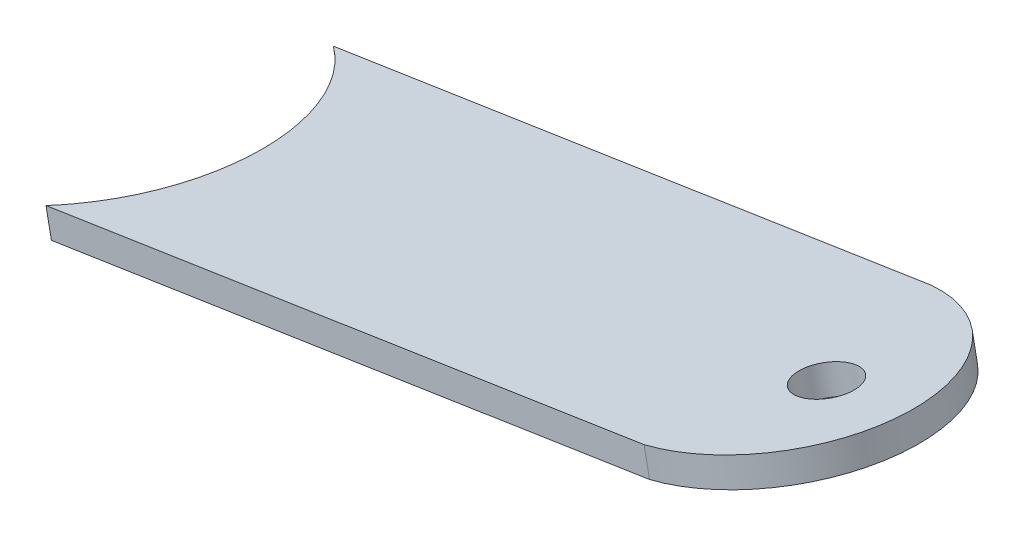
ISO-10303-21;
HEADER;
FILE_DESCRIPTION(('STEP AP214'),'2;1');
FILE_NAME('part.step','',(''),(''),'','','');
FILE_SCHEMA(('AUTOMOTIVE_DESIGN { 1 0 10303 214 1 1 1 1 }'));
ENDSEC;
DATA;
#1=APPLICATION_CONTEXT('core data for automotive mechanical design processes');
#2=APPLICATION_PROTOCOL_DEFINITION('international standard','automotive_design',2000,#1);
#3=PRODUCT_CONTEXT('',#1,'mechanical');
#4=PRODUCT('Part','Part','',(#3));
#5=PRODUCT_RELATED_PRODUCT_CATEGORY('part','',(#4));
#6=PRODUCT_DEFINITION_FORMATION('','',#4);
#7=PRODUCT_DEFINITION_CONTEXT('part definition',#1,'design');
#8=PRODUCT_DEFINITION('design','',#6,#7);
#9=PRODUCT_DEFINITION_SHAPE('','',#8);
#10=(LENGTH_UNIT() NAMED_UNIT(*) SI_UNIT(.MILLI.,.METRE.));
#11=(NAMED_UNIT(*) PLANE_ANGLE_UNIT() SI_UNIT($,.RADIAN.));
#12=(NAMED_UNIT(*) SI_UNIT($,.STERADIAN.) SOLID_ANGLE_UNIT());
#13=UNCERTAINTY_MEASURE_WITH_UNIT(LENGTH_MEASURE(1.E-05),#10,'distance_accuracy_value','');
#14=(GEOMETRIC_REPRESENTATION_CONTEXT(3) GLOBAL_UNCERTAINTY_ASSIGNED_CONTEXT((#13)) GLOBAL_UNIT_ASSIGNED_CONTEXT((#10,
#11,#12)) REPRESENTATION_CONTEXT('',''));
#15=CARTESIAN_POINT('',(0.,0.,0.));
#16=DIRECTION('',(0.,0.,1.));
#17=DIRECTION('',(1.,0.,0.));
#18=AXIS2_PLACEMENT_3D('',#15,#16,#17);
#19=CARTESIAN_POINT('',(917.303712479927,-302.19596538052,-592.22657392993));
#20=CARTESIAN_POINT('',(1058.24265332336,-274.58797589045,-622.199432067129));
#21=CARTESIAN_POINT('',(1018.43912019593,-282.384937593677,-488.850736669417));
#22=CARTESIAN_POINT('',(912.307050962627,-303.174742273758,-570.07336242027));
#23=(BOUNDED_CURVE() B_SPLINE_CURVE(3,(#19,#20,#21,#22),.UNSPECIFIED.,.F.,
.F.) B_SPLINE_CURVE_WITH_KNOTS((4,4),(-1.45563912941593,2.47269988309875),
.UNSPECIFIED.) CURVE() GEOMETRIC_REPRESENTATION_ITEM() RATIONAL_B_SPLINE_CURVE((2.95017647068925,
0.15594702474745,0.168135280646364,2.98674123838599)) REPRESENTATION_ITEM(''));
#24=DIRECTION('',(0.192232768347809,-0.981349358166264,0.));
#25=VECTOR('',#24,1.);
#26=SURFACE_OF_LINEAR_EXTRUSION('',#23,#25);
#27=DIRECTION('',(0.192232768347809,-0.981349358166264,0.));
#28=VECTOR('',#27,1.);
#29=CARTESIAN_POINT('',(927.14613441403,-300.267971032844,-569.811781148016));
#30=LINE('',#29,#28);
#31=CARTESIAN_POINT('',(927.14613441403,-300.267971032844,-569.811781148016));
#32=VERTEX_POINT('',#31);
#33=CARTESIAN_POINT('',(927.530599950726,-302.230669749177,-569.811781148016));
#34=VERTEX_POINT('',#33);
#35=EDGE_CURVE('E41',#32,#34,#30,.T.);
#36=ORIENTED_EDGE('',*,*,#35,.F.);
#37=CARTESIAN_POINT('',(927.650023279181,-300.169266172356,-589.810571864873));
#38=VERTEX_POINT('',#37);
#39=EDGE_CURVE('E110',#38,#32,#23,.T.);
#40=ORIENTED_EDGE('',*,*,#39,.F.);
#41=DIRECTION('',(0.192232768347809,-0.981349358166264,0.));
#42=VECTOR('',#41,1.);
#43=CARTESIAN_POINT('',(927.650023279181,-300.169266172356,-589.810571864873));
#44=LINE('',#43,#42);
#45=CARTESIAN_POINT('',(928.034488815876,-302.131964888689,-589.810571864873));
#46=VERTEX_POINT('',#45);
#47=EDGE_CURVE('E11',#38,#46,#44,.T.);
#48=ORIENTED_EDGE('',*,*,#47,.T.);
#49=CARTESIAN_POINT('',(917.688178016623,-304.158664096852,-592.22657392993));
#50=CARTESIAN_POINT('',(1058.62711886006,-276.550674606782,-622.199432067129));
#51=CARTESIAN_POINT('',(1018.82358573263,-284.34763631001,-488.850736669417));
#52=CARTESIAN_POINT('',(912.691516499323,-305.137440990091,-570.07336242027));
#53=(BOUNDED_CURVE() B_SPLINE_CURVE(3,(#49,#50,#51,#52),.UNSPECIFIED.,.F.,
.F.) B_SPLINE_CURVE_WITH_KNOTS((4,4),(-1.45563912941593,2.47269988309875),
.UNSPECIFIED.) CURVE() GEOMETRIC_REPRESENTATION_ITEM() RATIONAL_B_SPLINE_CURVE((2.95017647068925,
0.15594702474745,0.168135280646364,2.98674123838599)) REPRESENTATION_ITEM(''));
#54=EDGE_CURVE('E84',#46,#34,#53,.T.);
#55=ORIENTED_EDGE('',*,*,#54,.T.);
#56=EDGE_LOOP('',(#36,#40,#48,#55));
#57=FACE_BOUND('',#56,.T.);
#58=ADVANCED_FACE('F37',(#57),#26,.F.);
#59=CARTESIAN_POINT('',(927.650023279181,-300.169266172356,-589.810571864873));
#60=DIRECTION('',(0.0479335578120103,0.00938952111017875,-0.998806393115705));
#61=DIRECTION('',(0.998850424964509,0.,0.0479356709374216));
#62=AXIS2_PLACEMENT_3D('',#59,#60,#61);
#63=PLANE('',#62);
#64=ORIENTED_EDGE('',*,*,#47,.F.);
#65=DIRECTION('',(-0.980178012816458,-0.192003317992122,-0.0488445398299117));
#66=VECTOR('',#65,1.);
#67=CARTESIAN_POINT('',(927.650023279181,-300.169266172356,-589.810571864873));
#68=LINE('',#67,#66);
#69=CARTESIAN_POINT('',(972.562736339804,-291.371486774215,-587.57246738459));
#70=VERTEX_POINT('',#69);
#71=EDGE_CURVE('E54',#70,#38,#68,.T.);
#72=ORIENTED_EDGE('',*,*,#71,.F.);
#73=DIRECTION('',(0.192232768347809,-0.981349358166264,0.));
#74=VECTOR('',#73,1.);
#75=CARTESIAN_POINT('',(972.562736339804,-291.371486774215,-587.57246738459));
#76=LINE('',#75,#74);
#77=CARTESIAN_POINT('',(972.9472018765,-293.334185490547,-587.57246738459));
#78=VERTEX_POINT('',#77);
#79=EDGE_CURVE('E46',#70,#78,#76,.T.);
#80=ORIENTED_EDGE('',*,*,#79,.T.);
#81=DIRECTION('',(-0.980178012816458,-0.192003317992122,-0.0488445398299117));
#82=VECTOR('',#81,1.);
#83=CARTESIAN_POINT('',(928.034488815876,-302.131964888689,-589.810571864873));
#84=LINE('',#83,#82);
#85=EDGE_CURVE('E106',#78,#46,#84,.T.);
#86=ORIENTED_EDGE('',*,*,#85,.T.);
#87=EDGE_LOOP('',(#64,#72,#80,#86));
#88=FACE_BOUND('',#87,.T.);
#89=ADVANCED_FACE('F105',(#88),#63,.T.);
#90=CARTESIAN_POINT('',(971.407646481582,-291.597752903895,-577.596700813137));
#91=DIRECTION('',(0.192232768347809,-0.981349358166264,0.));
#92=DIRECTION('',(0.981349358166264,0.192232768347809,0.));
#93=AXIS2_PLACEMENT_3D('',#90,#91,#92);
#94=CYLINDRICAL_SURFACE('',#93,10.0449662831755);
#95=ORIENTED_EDGE('',*,*,#79,.F.);
#96=CARTESIAN_POINT('',(971.407646481582,-291.597752903895,-577.596700813137));
#97=DIRECTION('',(-0.192232768347809,0.981349358166264,0.));
#98=DIRECTION('',(-0.981349358166264,-0.192232768347809,0.));
#99=AXIS2_PLACEMENT_3D('',#96,#97,#98);
#100=CIRCLE('',#99,10.0449662831755);
#101=CARTESIAN_POINT('',(972.058847474654,-291.470191634703,-567.573676667733));
#102=VERTEX_POINT('',#101);
#103=EDGE_CURVE('E59',#102,#70,#100,.T.);
#104=ORIENTED_EDGE('',*,*,#103,.F.);
#105=DIRECTION('',(0.192232768347809,-0.981349358166264,0.));
#106=VECTOR('',#105,1.);
#107=CARTESIAN_POINT('',(972.058847474654,-291.470191634703,-567.573676667733));
#108=LINE('',#107,#106);
#109=CARTESIAN_POINT('',(972.44331301135,-293.432890351035,-567.573676667733));
#110=VERTEX_POINT('',#109);
#111=EDGE_CURVE('E98',#102,#110,#108,.T.);
#112=ORIENTED_EDGE('',*,*,#111,.T.);
#113=CARTESIAN_POINT('',(971.792112018278,-293.560451620228,-577.596700813137));
#114=DIRECTION('',(-0.192232768347809,0.981349358166264,0.));
#115=DIRECTION('',(-0.981349358166264,-0.192232768347809,0.));
#116=AXIS2_PLACEMENT_3D('',#113,#114,#115);
#117=CIRCLE('',#116,10.0449662831755);
#118=EDGE_CURVE('E85',#110,#78,#117,.T.);
#119=ORIENTED_EDGE('',*,*,#118,.T.);
#120=EDGE_LOOP('',(#95,#104,#112,#119));
#121=FACE_BOUND('',#120,.T.);
#122=ADVANCED_FACE('F108',(#121),#94,.T.);
#123=CARTESIAN_POINT('',(927.14613441403,-300.267971032844,-569.811781148016));
#124=DIRECTION('',(-0.0479335578120128,-0.00938952111017924,0.998806393115705));
#125=DIRECTION('',(-0.998850424964508,0.,-0.0479356709374241));
#126=AXIS2_PLACEMENT_3D('',#123,#124,#125);
#127=PLANE('',#126);
#128=ORIENTED_EDGE('',*,*,#111,.F.);
#129=DIRECTION('',(0.980178012816458,0.192003317992122,0.0488445398299142));
#130=VECTOR('',#129,1.);
#131=CARTESIAN_POINT('',(927.14613441403,-300.267971032844,-569.811781148016));
#132=LINE('',#131,#130);
#133=EDGE_CURVE('E97',#32,#102,#132,.T.);
#134=ORIENTED_EDGE('',*,*,#133,.F.);
#135=ORIENTED_EDGE('',*,*,#35,.T.);
#136=DIRECTION('',(0.980178012816458,0.192003317992122,0.0488445398299142));
#137=VECTOR('',#136,1.);
#138=CARTESIAN_POINT('',(927.530599950726,-302.230669749177,-569.811781148016));
#139=LINE('',#138,#137);
#140=EDGE_CURVE('E80',#34,#110,#139,.T.);
#141=ORIENTED_EDGE('',*,*,#140,.T.);
#142=EDGE_LOOP('',(#128,#134,#135,#141));
#143=FACE_BOUND('',#142,.T.);
#144=ADVANCED_FACE('F96',(#143),#127,.T.);
#145=CARTESIAN_POINT('',(932.070560064464,-299.303344146987,-577.132599749912));
#146=DIRECTION('',(0.192232768347809,-0.981349358166264,0.));
#147=DIRECTION('',(0.981349358166264,0.192232768347809,0.));
#148=AXIS2_PLACEMENT_3D('',#145,#146,#147);
#149=PLANE('',#148);
#150=CARTESIAN_POINT('',(975.217352006472,-290.851484275353,-577.428231406724));
#151=DIRECTION('',(-0.192232768347809,0.981349358166264,0.));
#152=DIRECTION('',(0.981349358166264,0.192232768347809,0.));
#153=AXIS2_PLACEMENT_3D('',#150,#151,#152);
#154=CIRCLE('',#153,1.99999999999988);
#155=CARTESIAN_POINT('',(977.180050722805,-290.467018738657,-577.428231406724));
#156=VERTEX_POINT('',#155);
#157=EDGE_CURVE('E94',#156,#156,#154,.T.);
#158=ORIENTED_EDGE('',*,*,#157,.F.);
#159=EDGE_LOOP('',(#158));
#160=FACE_BOUND('',#159,.T.);
#161=ORIENTED_EDGE('',*,*,#39,.T.);
#162=ORIENTED_EDGE('',*,*,#133,.T.);
#163=ORIENTED_EDGE('',*,*,#103,.T.);
#164=ORIENTED_EDGE('',*,*,#71,.T.);
#165=EDGE_LOOP('',(#161,#162,#163,#164));
#166=FACE_BOUND('',#165,.T.);
#167=ADVANCED_FACE('F118',(#160,#166),#149,.F.);
#168=CARTESIAN_POINT('',(932.45502560116,-301.266042863319,-577.132599749912));
#169=DIRECTION('',(0.192232768347809,-0.981349358166264,0.));
#170=DIRECTION('',(0.981349358166264,0.192232768347809,0.));
#171=AXIS2_PLACEMENT_3D('',#168,#169,#170);
#172=PLANE('',#171);
#173=CARTESIAN_POINT('',(975.601817543167,-292.814182991682,-577.428231406724));
#174=DIRECTION('',(-0.192232768347814,0.981349358166263,0.));
#175=DIRECTION('',(0.981349358166263,0.192232768347814,0.));
#176=AXIS2_PLACEMENT_3D('',#173,#174,#175);
#177=CIRCLE('',#176,1.99999999999988);
#178=CARTESIAN_POINT('',(977.564516259499,-292.429717454986,-577.428231406724));
#179=VERTEX_POINT('',#178);
#180=EDGE_CURVE('E171',#179,#179,#177,.T.);
#181=ORIENTED_EDGE('',*,*,#180,.T.);
#182=EDGE_LOOP('',(#181));
#183=FACE_BOUND('',#182,.T.);
#184=ORIENTED_EDGE('',*,*,#54,.F.);
#185=ORIENTED_EDGE('',*,*,#85,.F.);
#186=ORIENTED_EDGE('',*,*,#118,.F.);
#187=ORIENTED_EDGE('',*,*,#140,.F.);
#188=EDGE_LOOP('',(#184,#185,#186,#187));
#189=FACE_BOUND('',#188,.T.);
#190=ADVANCED_FACE('F82',(#183,#189),#172,.T.);
#191=CARTESIAN_POINT('',(973.217464011962,-280.642044871835,-577.428231406724));
#192=DIRECTION('',(0.192232768347814,-0.981349358166263,0.));
#193=DIRECTION('',(0.981349358166263,0.192232768347814,0.));
#194=AXIS2_PLACEMENT_3D('',#191,#192,#193);
#195=CYLINDRICAL_SURFACE('',#194,1.99999999999988);
#196=ORIENTED_EDGE('',*,*,#180,.F.);
#197=EDGE_LOOP('',(#196));
#198=FACE_BOUND('',#197,.T.);
#199=ORIENTED_EDGE('',*,*,#157,.T.);
#200=EDGE_LOOP('',(#199));
#201=FACE_BOUND('',#200,.T.);
#202=ADVANCED_FACE('F126',(#198,#201),#195,.F.);
#203=CLOSED_SHELL('',(#58,#89,#122,#144,#167,#190,#202));
#204=MANIFOLD_SOLID_BREP('B2',#203);
#205=ADVANCED_BREP_SHAPE_REPRESENTATION('',(#18,#204),#14);
#206=SHAPE_DEFINITION_REPRESENTATION(#9,#205);
ENDSEC;
END-ISO-10303-21;
